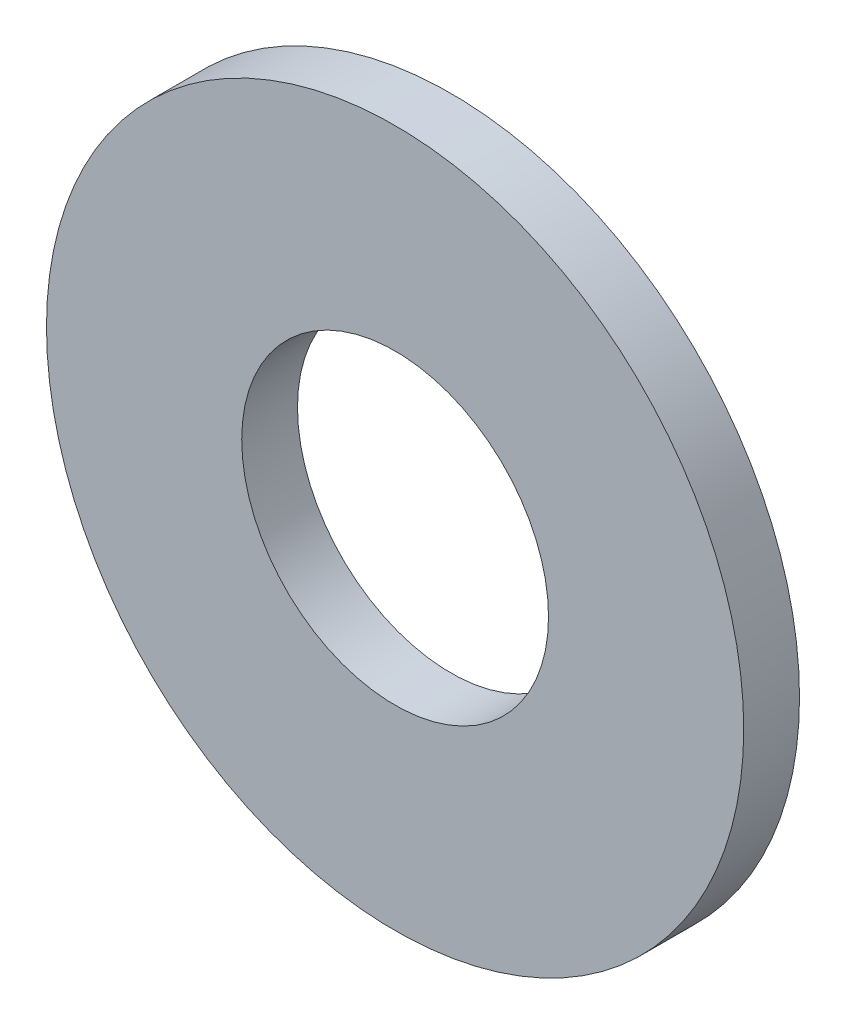
ISO-10303-21;
HEADER;
FILE_DESCRIPTION(('STEP AP214'),'2;1');
FILE_NAME('part.step','',(''),(''),'','','');
FILE_SCHEMA(('AUTOMOTIVE_DESIGN { 1 0 10303 214 1 1 1 1 }'));
ENDSEC;
DATA;
#1=APPLICATION_CONTEXT('core data for automotive mechanical design processes');
#2=APPLICATION_PROTOCOL_DEFINITION('international standard','automotive_design',2000,#1);
#3=PRODUCT_CONTEXT('',#1,'mechanical');
#4=PRODUCT('Part','Part','',(#3));
#5=PRODUCT_RELATED_PRODUCT_CATEGORY('part','',(#4));
#6=PRODUCT_DEFINITION_FORMATION('','',#4);
#7=PRODUCT_DEFINITION_CONTEXT('part definition',#1,'design');
#8=PRODUCT_DEFINITION('design','',#6,#7);
#9=PRODUCT_DEFINITION_SHAPE('','',#8);
#10=(LENGTH_UNIT() NAMED_UNIT(*) SI_UNIT(.MILLI.,.METRE.));
#11=(NAMED_UNIT(*) PLANE_ANGLE_UNIT() SI_UNIT($,.RADIAN.));
#12=(NAMED_UNIT(*) SI_UNIT($,.STERADIAN.) SOLID_ANGLE_UNIT());
#13=UNCERTAINTY_MEASURE_WITH_UNIT(LENGTH_MEASURE(1.E-05),#10,'distance_accuracy_value','');
#14=(GEOMETRIC_REPRESENTATION_CONTEXT(3) GLOBAL_UNCERTAINTY_ASSIGNED_CONTEXT((#13)) GLOBAL_UNIT_ASSIGNED_CONTEXT((#10,
#11,#12)) REPRESENTATION_CONTEXT('',''));
#15=CARTESIAN_POINT('',(0.,0.,0.));
#16=DIRECTION('',(0.,0.,1.));
#17=DIRECTION('',(1.,0.,0.));
#18=AXIS2_PLACEMENT_3D('',#15,#16,#17);
#19=CARTESIAN_POINT('',(0.,0.,0.4));
#20=DIRECTION('',(0.,0.,1.));
#21=DIRECTION('',(1.,0.,0.));
#22=AXIS2_PLACEMENT_3D('',#19,#20,#21);
#23=PLANE('',#22);
#24=CARTESIAN_POINT('',(0.,0.,0.4));
#25=DIRECTION('',(0.,0.,1.));
#26=DIRECTION('',(1.,0.,0.));
#27=AXIS2_PLACEMENT_3D('',#24,#25,#26);
#28=CIRCLE('',#27,2.5);
#29=CARTESIAN_POINT('',(2.5,0.,0.4));
#30=VERTEX_POINT('',#29);
#31=EDGE_CURVE('E10',#30,#30,#28,.T.);
#32=ORIENTED_EDGE('',*,*,#31,.T.);
#33=EDGE_LOOP('',(#32));
#34=FACE_BOUND('',#33,.T.);
#35=CARTESIAN_POINT('',(0.,0.,0.4));
#36=DIRECTION('',(0.,0.,1.));
#37=DIRECTION('',(1.,0.,0.));
#38=AXIS2_PLACEMENT_3D('',#35,#36,#37);
#39=CIRCLE('',#38,1.1);
#40=CARTESIAN_POINT('',(1.1,0.,0.4));
#41=VERTEX_POINT('',#40);
#42=EDGE_CURVE('E54',#41,#41,#39,.T.);
#43=ORIENTED_EDGE('',*,*,#42,.F.);
#44=EDGE_LOOP('',(#43));
#45=FACE_BOUND('',#44,.T.);
#46=ADVANCED_FACE('F41',(#34,#45),#23,.T.);
#47=CARTESIAN_POINT('',(0.,0.,0.));
#48=DIRECTION('',(0.,0.,1.));
#49=DIRECTION('',(1.,0.,0.));
#50=AXIS2_PLACEMENT_3D('',#47,#48,#49);
#51=PLANE('',#50);
#52=CARTESIAN_POINT('',(0.,0.,0.));
#53=DIRECTION('',(0.,0.,1.));
#54=DIRECTION('',(1.,0.,0.));
#55=AXIS2_PLACEMENT_3D('',#52,#53,#54);
#56=CIRCLE('',#55,2.5);
#57=CARTESIAN_POINT('',(2.5,0.,0.));
#58=VERTEX_POINT('',#57);
#59=EDGE_CURVE('E45',#58,#58,#56,.T.);
#60=ORIENTED_EDGE('',*,*,#59,.F.);
#61=EDGE_LOOP('',(#60));
#62=FACE_BOUND('',#61,.T.);
#63=CARTESIAN_POINT('',(0.,0.,0.));
#64=DIRECTION('',(0.,0.,1.));
#65=DIRECTION('',(1.,0.,0.));
#66=AXIS2_PLACEMENT_3D('',#63,#64,#65);
#67=CIRCLE('',#66,1.1);
#68=CARTESIAN_POINT('',(1.1,0.,0.));
#69=VERTEX_POINT('',#68);
#70=EDGE_CURVE('E56',#69,#69,#67,.T.);
#71=ORIENTED_EDGE('',*,*,#70,.T.);
#72=EDGE_LOOP('',(#71));
#73=FACE_BOUND('',#72,.T.);
#74=ADVANCED_FACE('F68',(#62,#73),#51,.F.);
#75=CARTESIAN_POINT('',(0.,0.,0.4));
#76=DIRECTION('',(0.,0.,-1.));
#77=DIRECTION('',(-1.,0.,0.));
#78=AXIS2_PLACEMENT_3D('',#75,#76,#77);
#79=CYLINDRICAL_SURFACE('',#78,2.5);
#80=ORIENTED_EDGE('',*,*,#31,.F.);
#81=EDGE_LOOP('',(#80));
#82=FACE_BOUND('',#81,.T.);
#83=ORIENTED_EDGE('',*,*,#59,.T.);
#84=EDGE_LOOP('',(#83));
#85=FACE_BOUND('',#84,.T.);
#86=ADVANCED_FACE('F43',(#82,#85),#79,.T.);
#87=CARTESIAN_POINT('',(0.,0.,0.4));
#88=DIRECTION('',(0.,0.,-1.));
#89=DIRECTION('',(-1.,0.,0.));
#90=AXIS2_PLACEMENT_3D('',#87,#88,#89);
#91=CYLINDRICAL_SURFACE('',#90,1.1);
#92=ORIENTED_EDGE('',*,*,#42,.T.);
#93=EDGE_LOOP('',(#92));
#94=FACE_BOUND('',#93,.T.);
#95=ORIENTED_EDGE('',*,*,#70,.F.);
#96=EDGE_LOOP('',(#95));
#97=FACE_BOUND('',#96,.T.);
#98=ADVANCED_FACE('F64',(#94,#97),#91,.F.);
#99=CLOSED_SHELL('',(#46,#74,#86,#98));
#100=MANIFOLD_SOLID_BREP('B2',#99);
#101=ADVANCED_BREP_SHAPE_REPRESENTATION('',(#18,#100),#14);
#102=SHAPE_DEFINITION_REPRESENTATION(#9,#101);
ENDSEC;
END-ISO-10303-21;
